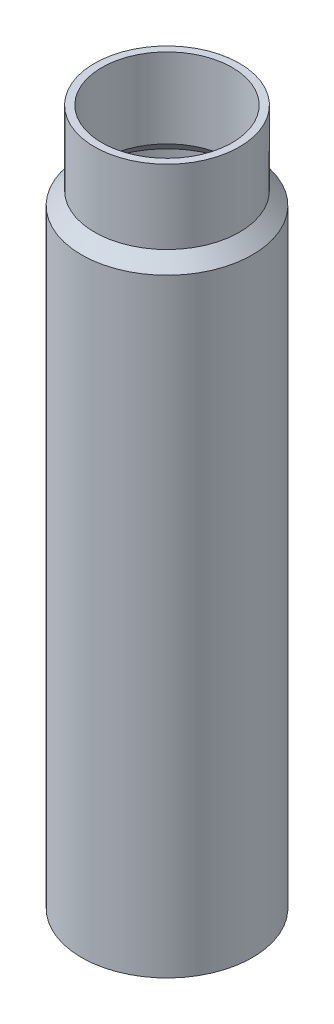
ISO-10303-21;
HEADER;
FILE_DESCRIPTION(('STEP AP214'),'2;1');
FILE_NAME('part.step','',(''),(''),'','','');
FILE_SCHEMA(('AUTOMOTIVE_DESIGN { 1 0 10303 214 1 1 1 1 }'));
ENDSEC;
DATA;
#1=APPLICATION_CONTEXT('core data for automotive mechanical design processes');
#2=APPLICATION_PROTOCOL_DEFINITION('international standard','automotive_design',2000,#1);
#3=PRODUCT_CONTEXT('',#1,'mechanical');
#4=PRODUCT('Part','Part','',(#3));
#5=PRODUCT_RELATED_PRODUCT_CATEGORY('part','',(#4));
#6=PRODUCT_DEFINITION_FORMATION('','',#4);
#7=PRODUCT_DEFINITION_CONTEXT('part definition',#1,'design');
#8=PRODUCT_DEFINITION('design','',#6,#7);
#9=PRODUCT_DEFINITION_SHAPE('','',#8);
#10=(LENGTH_UNIT() NAMED_UNIT(*) SI_UNIT(.MILLI.,.METRE.));
#11=(NAMED_UNIT(*) PLANE_ANGLE_UNIT() SI_UNIT($,.RADIAN.));
#12=(NAMED_UNIT(*) SI_UNIT($,.STERADIAN.) SOLID_ANGLE_UNIT());
#13=UNCERTAINTY_MEASURE_WITH_UNIT(LENGTH_MEASURE(1.E-05),#10,'distance_accuracy_value','');
#14=(GEOMETRIC_REPRESENTATION_CONTEXT(3) GLOBAL_UNCERTAINTY_ASSIGNED_CONTEXT((#13)) GLOBAL_UNIT_ASSIGNED_CONTEXT((#10,
#11,#12)) REPRESENTATION_CONTEXT('',''));
#15=CARTESIAN_POINT('',(0.,0.,0.));
#16=DIRECTION('',(0.,0.,1.));
#17=DIRECTION('',(1.,0.,0.));
#18=AXIS2_PLACEMENT_3D('',#15,#16,#17);
#19=CARTESIAN_POINT('',(0.,0.,0.));
#20=DIRECTION('',(0.,-1.,0.));
#21=DIRECTION('',(0.,0.,-1.));
#22=AXIS2_PLACEMENT_3D('',#19,#20,#21);
#23=PLANE('',#22);
#24=CARTESIAN_POINT('',(0.,0.,0.));
#25=DIRECTION('',(0.,-1.,0.));
#26=DIRECTION('',(0.,0.,-1.));
#27=AXIS2_PLACEMENT_3D('',#24,#25,#26);
#28=CIRCLE('',#27,37.465);
#29=CARTESIAN_POINT('',(0.,0.,-37.465));
#30=VERTEX_POINT('',#29);
#31=EDGE_CURVE('E10',#30,#30,#28,.T.);
#32=ORIENTED_EDGE('',*,*,#31,.T.);
#33=EDGE_LOOP('',(#32));
#34=FACE_BOUND('',#33,.T.);
#35=ADVANCED_FACE('F30',(#34),#23,.T.);
#36=CARTESIAN_POINT('',(0.,0.,0.));
#37=DIRECTION('',(0.,-1.,0.));
#38=DIRECTION('',(0.,0.,-1.));
#39=AXIS2_PLACEMENT_3D('',#36,#37,#38);
#40=CYLINDRICAL_SURFACE('',#39,37.465);
#41=CARTESIAN_POINT('',(0.,266.7,0.));
#42=DIRECTION('',(0.,-1.,0.));
#43=DIRECTION('',(0.,0.,-1.));
#44=AXIS2_PLACEMENT_3D('',#41,#42,#43);
#45=CIRCLE('',#44,37.465);
#46=CARTESIAN_POINT('',(0.,266.7,-37.465));
#47=VERTEX_POINT('',#46);
#48=EDGE_CURVE('E36',#47,#47,#45,.T.);
#49=ORIENTED_EDGE('',*,*,#48,.T.);
#50=EDGE_LOOP('',(#49));
#51=FACE_BOUND('',#50,.T.);
#52=ORIENTED_EDGE('',*,*,#31,.F.);
#53=EDGE_LOOP('',(#52));
#54=FACE_BOUND('',#53,.T.);
#55=ADVANCED_FACE('F74',(#51,#54),#40,.T.);
#56=CARTESIAN_POINT('',(0.,266.7,0.));
#57=DIRECTION('',(0.,-1.,0.));
#58=DIRECTION('',(0.,0.,-1.));
#59=AXIS2_PLACEMENT_3D('',#56,#57,#58);
#60=CONICAL_SURFACE('',#59,37.465,0.785398163397451);
#61=CARTESIAN_POINT('',(0.,272.415,0.));
#62=DIRECTION('',(0.,-1.,0.));
#63=DIRECTION('',(0.,0.,-1.));
#64=AXIS2_PLACEMENT_3D('',#61,#62,#63);
#65=CIRCLE('',#64,31.75);
#66=CARTESIAN_POINT('',(0.,272.415,-31.75));
#67=VERTEX_POINT('',#66);
#68=EDGE_CURVE('E40',#67,#67,#65,.T.);
#69=ORIENTED_EDGE('',*,*,#68,.T.);
#70=EDGE_LOOP('',(#69));
#71=FACE_BOUND('',#70,.T.);
#72=ORIENTED_EDGE('',*,*,#48,.F.);
#73=EDGE_LOOP('',(#72));
#74=FACE_BOUND('',#73,.T.);
#75=ADVANCED_FACE('F78',(#71,#74),#60,.T.);
#76=CARTESIAN_POINT('',(0.,0.,0.));
#77=DIRECTION('',(0.,-1.,0.));
#78=DIRECTION('',(0.,0.,-1.));
#79=AXIS2_PLACEMENT_3D('',#76,#77,#78);
#80=CYLINDRICAL_SURFACE('',#79,31.75);
#81=CARTESIAN_POINT('',(0.,304.8,0.));
#82=DIRECTION('',(0.,-1.,0.));
#83=DIRECTION('',(0.,0.,-1.));
#84=AXIS2_PLACEMENT_3D('',#81,#82,#83);
#85=CIRCLE('',#84,31.75);
#86=CARTESIAN_POINT('',(0.,304.8,-31.75));
#87=VERTEX_POINT('',#86);
#88=EDGE_CURVE('E44',#87,#87,#85,.T.);
#89=ORIENTED_EDGE('',*,*,#88,.T.);
#90=EDGE_LOOP('',(#89));
#91=FACE_BOUND('',#90,.T.);
#92=ORIENTED_EDGE('',*,*,#68,.F.);
#93=EDGE_LOOP('',(#92));
#94=FACE_BOUND('',#93,.T.);
#95=ADVANCED_FACE('F82',(#91,#94),#80,.T.);
#96=CARTESIAN_POINT('',(31.75,304.8,0.));
#97=DIRECTION('',(0.,1.,0.));
#98=DIRECTION('',(0.,0.,1.));
#99=AXIS2_PLACEMENT_3D('',#96,#97,#98);
#100=PLANE('',#99);
#101=CARTESIAN_POINT('',(0.,304.8,0.));
#102=DIRECTION('',(0.,-1.,0.));
#103=DIRECTION('',(0.,0.,-1.));
#104=AXIS2_PLACEMENT_3D('',#101,#102,#103);
#105=CIRCLE('',#104,28.575);
#106=CARTESIAN_POINT('',(0.,304.8,-28.575));
#107=VERTEX_POINT('',#106);
#108=EDGE_CURVE('E49',#107,#107,#105,.T.);
#109=ORIENTED_EDGE('',*,*,#108,.T.);
#110=EDGE_LOOP('',(#109));
#111=FACE_BOUND('',#110,.T.);
#112=ORIENTED_EDGE('',*,*,#88,.F.);
#113=EDGE_LOOP('',(#112));
#114=FACE_BOUND('',#113,.T.);
#115=ADVANCED_FACE('F89',(#111,#114),#100,.T.);
#116=CARTESIAN_POINT('',(0.,0.,0.));
#117=DIRECTION('',(0.,-1.,0.));
#118=DIRECTION('',(0.,0.,-1.));
#119=AXIS2_PLACEMENT_3D('',#116,#117,#118);
#120=CYLINDRICAL_SURFACE('',#119,28.575);
#121=CARTESIAN_POINT('',(0.,269.875,0.));
#122=DIRECTION('',(0.,-1.,0.));
#123=DIRECTION('',(0.,0.,-1.));
#124=AXIS2_PLACEMENT_3D('',#121,#122,#123);
#125=CIRCLE('',#124,28.575);
#126=CARTESIAN_POINT('',(0.,269.875,-28.575));
#127=VERTEX_POINT('',#126);
#128=EDGE_CURVE('E52',#127,#127,#125,.T.);
#129=ORIENTED_EDGE('',*,*,#128,.T.);
#130=EDGE_LOOP('',(#129));
#131=FACE_BOUND('',#130,.T.);
#132=ORIENTED_EDGE('',*,*,#108,.F.);
#133=EDGE_LOOP('',(#132));
#134=FACE_BOUND('',#133,.T.);
#135=ADVANCED_FACE('F93',(#131,#134),#120,.F.);
#136=CARTESIAN_POINT('',(0.,269.875,0.));
#137=DIRECTION('',(0.,-1.,0.));
#138=DIRECTION('',(0.,0.,-1.));
#139=AXIS2_PLACEMENT_3D('',#136,#137,#138);
#140=CONICAL_SURFACE('',#139,28.575,0.785398163397451);
#141=CARTESIAN_POINT('',(0.,263.525,0.));
#142=DIRECTION('',(0.,-1.,0.));
#143=DIRECTION('',(0.,0.,-1.));
#144=AXIS2_PLACEMENT_3D('',#141,#142,#143);
#145=CIRCLE('',#144,34.925);
#146=CARTESIAN_POINT('',(0.,263.525,-34.925));
#147=VERTEX_POINT('',#146);
#148=EDGE_CURVE('E55',#147,#147,#145,.T.);
#149=ORIENTED_EDGE('',*,*,#148,.T.);
#150=EDGE_LOOP('',(#149));
#151=FACE_BOUND('',#150,.T.);
#152=ORIENTED_EDGE('',*,*,#128,.F.);
#153=EDGE_LOOP('',(#152));
#154=FACE_BOUND('',#153,.T.);
#155=ADVANCED_FACE('F71',(#151,#154),#140,.F.);
#156=CARTESIAN_POINT('',(0.,0.,0.));
#157=DIRECTION('',(0.,-1.,0.));
#158=DIRECTION('',(0.,0.,-1.));
#159=AXIS2_PLACEMENT_3D('',#156,#157,#158);
#160=CYLINDRICAL_SURFACE('',#159,34.925);
#161=CARTESIAN_POINT('',(0.,3.175,0.));
#162=DIRECTION('',(0.,-1.,0.));
#163=DIRECTION('',(0.,0.,-1.));
#164=AXIS2_PLACEMENT_3D('',#161,#162,#163);
#165=CIRCLE('',#164,34.925);
#166=CARTESIAN_POINT('',(0.,3.175,-34.925));
#167=VERTEX_POINT('',#166);
#168=EDGE_CURVE('E58',#167,#167,#165,.T.);
#169=ORIENTED_EDGE('',*,*,#168,.T.);
#170=EDGE_LOOP('',(#169));
#171=FACE_BOUND('',#170,.T.);
#172=ORIENTED_EDGE('',*,*,#148,.F.);
#173=EDGE_LOOP('',(#172));
#174=FACE_BOUND('',#173,.T.);
#175=ADVANCED_FACE('F62',(#171,#174),#160,.F.);
#176=CARTESIAN_POINT('',(0.,3.175,0.));
#177=DIRECTION('',(0.,1.,0.));
#178=DIRECTION('',(0.,0.,1.));
#179=AXIS2_PLACEMENT_3D('',#176,#177,#178);
#180=PLANE('',#179);
#181=ORIENTED_EDGE('',*,*,#168,.F.);
#182=EDGE_LOOP('',(#181));
#183=FACE_BOUND('',#182,.T.);
#184=ADVANCED_FACE('F65',(#183),#180,.T.);
#185=CLOSED_SHELL('',(#35,#55,#75,#95,#115,#135,#155,#175,#184));
#186=MANIFOLD_SOLID_BREP('B2',#185);
#187=ADVANCED_BREP_SHAPE_REPRESENTATION('',(#18,#186),#14);
#188=SHAPE_DEFINITION_REPRESENTATION(#9,#187);
ENDSEC;
END-ISO-10303-21;
